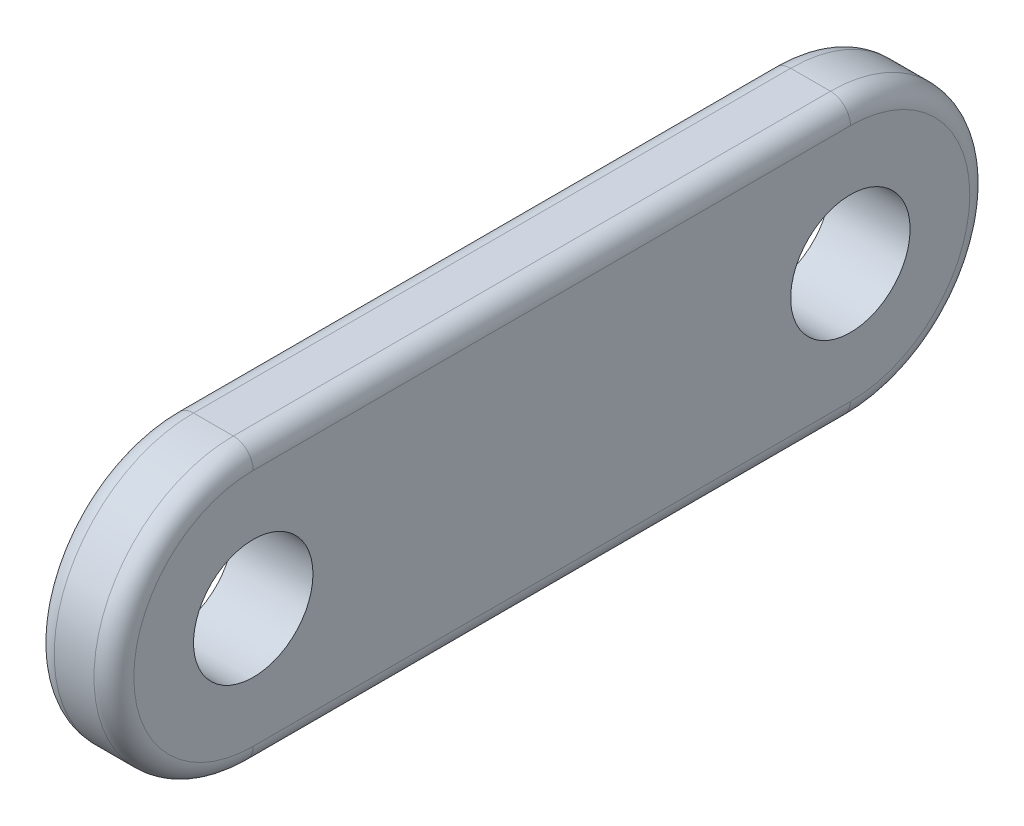
ISO-10303-21;
HEADER;
FILE_DESCRIPTION(('STEP AP214'),'2;1');
FILE_NAME('part.step','',(''),(''),'','','');
FILE_SCHEMA(('AUTOMOTIVE_DESIGN { 1 0 10303 214 1 1 1 1 }'));
ENDSEC;
DATA;
#1=APPLICATION_CONTEXT('core data for automotive mechanical design processes');
#2=APPLICATION_PROTOCOL_DEFINITION('international standard','automotive_design',2000,#1);
#3=PRODUCT_CONTEXT('',#1,'mechanical');
#4=PRODUCT('Part','Part','',(#3));
#5=PRODUCT_RELATED_PRODUCT_CATEGORY('part','',(#4));
#6=PRODUCT_DEFINITION_FORMATION('','',#4);
#7=PRODUCT_DEFINITION_CONTEXT('part definition',#1,'design');
#8=PRODUCT_DEFINITION('design','',#6,#7);
#9=PRODUCT_DEFINITION_SHAPE('','',#8);
#10=(LENGTH_UNIT() NAMED_UNIT(*) SI_UNIT(.MILLI.,.METRE.));
#11=(NAMED_UNIT(*) PLANE_ANGLE_UNIT() SI_UNIT($,.RADIAN.));
#12=(NAMED_UNIT(*) SI_UNIT($,.STERADIAN.) SOLID_ANGLE_UNIT());
#13=UNCERTAINTY_MEASURE_WITH_UNIT(LENGTH_MEASURE(1.E-05),#10,'distance_accuracy_value','');
#14=(GEOMETRIC_REPRESENTATION_CONTEXT(3) GLOBAL_UNCERTAINTY_ASSIGNED_CONTEXT((#13)) GLOBAL_UNIT_ASSIGNED_CONTEXT((#10,
#11,#12)) REPRESENTATION_CONTEXT('',''));
#15=CARTESIAN_POINT('',(0.,0.,0.));
#16=DIRECTION('',(0.,0.,1.));
#17=DIRECTION('',(1.,0.,0.));
#18=AXIS2_PLACEMENT_3D('',#15,#16,#17);
#19=CARTESIAN_POINT('',(4.,0.,15.));
#20=DIRECTION('',(1.,0.,0.));
#21=DIRECTION('',(0.,0.,-1.));
#22=AXIS2_PLACEMENT_3D('',#19,#20,#21);
#23=PLANE('',#22);
#24=DIRECTION('',(0.,0.,-1.));
#25=VECTOR('',#24,1.);
#26=CARTESIAN_POINT('',(4.,-6.00000000000001,-15.));
#27=LINE('',#26,#25);
#28=CARTESIAN_POINT('',(4.,-6.00000000000001,15.));
#29=VERTEX_POINT('',#28);
#30=CARTESIAN_POINT('',(4.,-6.00000000000001,-15.));
#31=VERTEX_POINT('',#30);
#32=EDGE_CURVE('E62',#29,#31,#27,.T.);
#33=ORIENTED_EDGE('',*,*,#32,.T.);
#34=CARTESIAN_POINT('',(4.,0.,-15.));
#35=DIRECTION('',(1.,0.,0.));
#36=DIRECTION('',(0.,0.,-1.));
#37=AXIS2_PLACEMENT_3D('',#34,#35,#36);
#38=CIRCLE('',#37,6.00000000000001);
#39=CARTESIAN_POINT('',(4.,6.00000000000001,-15.));
#40=VERTEX_POINT('',#39);
#41=EDGE_CURVE('E122',#31,#40,#38,.T.);
#42=ORIENTED_EDGE('',*,*,#41,.T.);
#43=DIRECTION('',(0.,0.,1.));
#44=VECTOR('',#43,1.);
#45=CARTESIAN_POINT('',(4.,6.00000000000001,15.));
#46=LINE('',#45,#44);
#47=CARTESIAN_POINT('',(4.,6.00000000000001,15.));
#48=VERTEX_POINT('',#47);
#49=EDGE_CURVE('E148',#40,#48,#46,.T.);
#50=ORIENTED_EDGE('',*,*,#49,.T.);
#51=CARTESIAN_POINT('',(4.,0.,15.));
#52=DIRECTION('',(1.,0.,0.));
#53=DIRECTION('',(0.,0.,-1.));
#54=AXIS2_PLACEMENT_3D('',#51,#52,#53);
#55=CIRCLE('',#54,6.00000000000001);
#56=EDGE_CURVE('E67',#48,#29,#55,.T.);
#57=ORIENTED_EDGE('',*,*,#56,.T.);
#58=EDGE_LOOP('',(#33,#42,#50,#57));
#59=FACE_BOUND('',#58,.T.);
#60=CARTESIAN_POINT('',(4.,0.,15.));
#61=DIRECTION('',(1.,0.,0.));
#62=DIRECTION('',(0.,0.,-1.));
#63=AXIS2_PLACEMENT_3D('',#60,#61,#62);
#64=CIRCLE('',#63,2.99999999999999);
#65=CARTESIAN_POINT('',(4.,0.,12.));
#66=VERTEX_POINT('',#65);
#67=EDGE_CURVE('E202',#66,#66,#64,.T.);
#68=ORIENTED_EDGE('',*,*,#67,.F.);
#69=EDGE_LOOP('',(#68));
#70=FACE_BOUND('',#69,.T.);
#71=CARTESIAN_POINT('',(4.,0.,-15.));
#72=DIRECTION('',(1.,0.,0.));
#73=DIRECTION('',(0.,0.,-1.));
#74=AXIS2_PLACEMENT_3D('',#71,#72,#73);
#75=CIRCLE('',#74,3.);
#76=CARTESIAN_POINT('',(4.,0.,-18.));
#77=VERTEX_POINT('',#76);
#78=EDGE_CURVE('E192',#77,#77,#75,.T.);
#79=ORIENTED_EDGE('',*,*,#78,.F.);
#80=EDGE_LOOP('',(#79));
#81=FACE_BOUND('',#80,.T.);
#82=ADVANCED_FACE('F44',(#59,#70,#81),#23,.T.);
#83=CARTESIAN_POINT('',(0.,0.,15.));
#84=DIRECTION('',(1.,0.,0.));
#85=DIRECTION('',(0.,0.,-1.));
#86=AXIS2_PLACEMENT_3D('',#83,#84,#85);
#87=PLANE('',#86);
#88=DIRECTION('',(0.,0.,1.));
#89=VECTOR('',#88,1.);
#90=CARTESIAN_POINT('',(0.,6.00000000000001,15.));
#91=LINE('',#90,#89);
#92=CARTESIAN_POINT('',(0.,6.00000000000001,15.));
#93=VERTEX_POINT('',#92);
#94=CARTESIAN_POINT('',(0.,6.00000000000001,-15.));
#95=VERTEX_POINT('',#94);
#96=EDGE_CURVE('E218',#93,#95,#91,.F.);
#97=ORIENTED_EDGE('',*,*,#96,.T.);
#98=CARTESIAN_POINT('',(0.,0.,-15.));
#99=DIRECTION('',(1.,0.,0.));
#100=DIRECTION('',(0.,0.,-1.));
#101=AXIS2_PLACEMENT_3D('',#98,#99,#100);
#102=CIRCLE('',#101,6.00000000000001);
#103=CARTESIAN_POINT('',(0.,-6.00000000000001,-15.));
#104=VERTEX_POINT('',#103);
#105=EDGE_CURVE('E227',#95,#104,#102,.F.);
#106=ORIENTED_EDGE('',*,*,#105,.T.);
#107=DIRECTION('',(0.,0.,-1.));
#108=VECTOR('',#107,1.);
#109=CARTESIAN_POINT('',(0.,-6.00000000000001,15.));
#110=LINE('',#109,#108);
#111=CARTESIAN_POINT('',(0.,-6.00000000000001,15.));
#112=VERTEX_POINT('',#111);
#113=EDGE_CURVE('E224',#104,#112,#110,.F.);
#114=ORIENTED_EDGE('',*,*,#113,.T.);
#115=CARTESIAN_POINT('',(0.,0.,15.));
#116=DIRECTION('',(1.,0.,0.));
#117=DIRECTION('',(0.,0.,-1.));
#118=AXIS2_PLACEMENT_3D('',#115,#116,#117);
#119=CIRCLE('',#118,6.00000000000001);
#120=EDGE_CURVE('E221',#112,#93,#119,.F.);
#121=ORIENTED_EDGE('',*,*,#120,.T.);
#122=EDGE_LOOP('',(#97,#106,#114,#121));
#123=FACE_BOUND('',#122,.T.);
#124=CARTESIAN_POINT('',(0.,0.,15.));
#125=DIRECTION('',(1.,0.,0.));
#126=DIRECTION('',(0.,0.,-1.));
#127=AXIS2_PLACEMENT_3D('',#124,#125,#126);
#128=CIRCLE('',#127,2.99999999999999);
#129=CARTESIAN_POINT('',(0.,0.,12.));
#130=VERTEX_POINT('',#129);
#131=EDGE_CURVE('E199',#130,#130,#128,.T.);
#132=ORIENTED_EDGE('',*,*,#131,.T.);
#133=EDGE_LOOP('',(#132));
#134=FACE_BOUND('',#133,.T.);
#135=CARTESIAN_POINT('',(0.,0.,-15.));
#136=DIRECTION('',(1.,0.,0.));
#137=DIRECTION('',(0.,0.,-1.));
#138=AXIS2_PLACEMENT_3D('',#135,#136,#137);
#139=CIRCLE('',#138,3.);
#140=CARTESIAN_POINT('',(0.,0.,-18.));
#141=VERTEX_POINT('',#140);
#142=EDGE_CURVE('E184',#141,#141,#139,.T.);
#143=ORIENTED_EDGE('',*,*,#142,.T.);
#144=EDGE_LOOP('',(#143));
#145=FACE_BOUND('',#144,.T.);
#146=ADVANCED_FACE('F277',(#123,#134,#145),#87,.F.);
#147=CARTESIAN_POINT('',(4.,0.,15.));
#148=DIRECTION('',(-1.,0.,0.));
#149=DIRECTION('',(0.,0.,1.));
#150=AXIS2_PLACEMENT_3D('',#147,#148,#149);
#151=CYLINDRICAL_SURFACE('',#150,7.00000000000001);
#152=DIRECTION('',(-1.,0.,0.));
#153=VECTOR('',#152,1.);
#154=CARTESIAN_POINT('',(4.,7.00000000000001,15.));
#155=LINE('',#154,#153);
#156=CARTESIAN_POINT('',(3.,7.00000000000001,15.));
#157=VERTEX_POINT('',#156);
#158=CARTESIAN_POINT('',(1.,7.00000000000001,15.));
#159=VERTEX_POINT('',#158);
#160=EDGE_CURVE('E116',#157,#159,#155,.T.);
#161=ORIENTED_EDGE('',*,*,#160,.T.);
#162=CARTESIAN_POINT('',(1.,0.,15.));
#163=DIRECTION('',(1.,0.,0.));
#164=DIRECTION('',(0.,0.,-1.));
#165=AXIS2_PLACEMENT_3D('',#162,#163,#164);
#166=CIRCLE('',#165,7.00000000000001);
#167=CARTESIAN_POINT('',(1.,-7.00000000000001,15.));
#168=VERTEX_POINT('',#167);
#169=EDGE_CURVE('E240',#159,#168,#166,.T.);
#170=ORIENTED_EDGE('',*,*,#169,.T.);
#171=DIRECTION('',(-1.,0.,0.));
#172=VECTOR('',#171,1.);
#173=CARTESIAN_POINT('',(4.,-7.00000000000001,15.));
#174=LINE('',#173,#172);
#175=CARTESIAN_POINT('',(3.,-7.00000000000001,15.));
#176=VERTEX_POINT('',#175);
#177=EDGE_CURVE('E145',#176,#168,#174,.T.);
#178=ORIENTED_EDGE('',*,*,#177,.F.);
#179=CARTESIAN_POINT('',(3.,0.,15.));
#180=DIRECTION('',(1.,0.,0.));
#181=DIRECTION('',(0.,0.,-1.));
#182=AXIS2_PLACEMENT_3D('',#179,#180,#181);
#183=CIRCLE('',#182,7.00000000000001);
#184=EDGE_CURVE('E237',#176,#157,#183,.F.);
#185=ORIENTED_EDGE('',*,*,#184,.T.);
#186=EDGE_LOOP('',(#161,#170,#178,#185));
#187=FACE_BOUND('',#186,.T.);
#188=ADVANCED_FACE('F259',(#187),#151,.T.);
#189=CARTESIAN_POINT('',(4.,-7.00000000000001,15.));
#190=DIRECTION('',(0.,1.,0.));
#191=DIRECTION('',(0.,0.,1.));
#192=AXIS2_PLACEMENT_3D('',#189,#190,#191);
#193=PLANE('',#192);
#194=ORIENTED_EDGE('',*,*,#177,.T.);
#195=DIRECTION('',(0.,0.,-1.));
#196=VECTOR('',#195,1.);
#197=CARTESIAN_POINT('',(1.,-7.00000000000001,15.));
#198=LINE('',#197,#196);
#199=CARTESIAN_POINT('',(1.,-7.00000000000001,-15.));
#200=VERTEX_POINT('',#199);
#201=EDGE_CURVE('E234',#168,#200,#198,.T.);
#202=ORIENTED_EDGE('',*,*,#201,.T.);
#203=DIRECTION('',(-1.,0.,0.));
#204=VECTOR('',#203,1.);
#205=CARTESIAN_POINT('',(4.,-7.00000000000001,-15.));
#206=LINE('',#205,#204);
#207=CARTESIAN_POINT('',(3.,-7.00000000000001,-15.));
#208=VERTEX_POINT('',#207);
#209=EDGE_CURVE('E135',#208,#200,#206,.T.);
#210=ORIENTED_EDGE('',*,*,#209,.F.);
#211=DIRECTION('',(0.,0.,-1.));
#212=VECTOR('',#211,1.);
#213=CARTESIAN_POINT('',(3.,-7.00000000000001,15.));
#214=LINE('',#213,#212);
#215=EDGE_CURVE('E231',#208,#176,#214,.F.);
#216=ORIENTED_EDGE('',*,*,#215,.T.);
#217=EDGE_LOOP('',(#194,#202,#210,#216));
#218=FACE_BOUND('',#217,.T.);
#219=ADVANCED_FACE('F257',(#218),#193,.F.);
#220=CARTESIAN_POINT('',(4.,0.,-15.));
#221=DIRECTION('',(-1.,0.,0.));
#222=DIRECTION('',(0.,0.,1.));
#223=AXIS2_PLACEMENT_3D('',#220,#221,#222);
#224=CYLINDRICAL_SURFACE('',#223,7.00000000000001);
#225=ORIENTED_EDGE('',*,*,#209,.T.);
#226=CARTESIAN_POINT('',(1.,0.,-15.));
#227=DIRECTION('',(1.,0.,0.));
#228=DIRECTION('',(0.,0.,-1.));
#229=AXIS2_PLACEMENT_3D('',#226,#227,#228);
#230=CIRCLE('',#229,7.00000000000001);
#231=CARTESIAN_POINT('',(1.,7.00000000000001,-15.));
#232=VERTEX_POINT('',#231);
#233=EDGE_CURVE('E133',#200,#232,#230,.T.);
#234=ORIENTED_EDGE('',*,*,#233,.T.);
#235=DIRECTION('',(-1.,0.,0.));
#236=VECTOR('',#235,1.);
#237=CARTESIAN_POINT('',(4.,7.00000000000001,-15.));
#238=LINE('',#237,#236);
#239=CARTESIAN_POINT('',(3.,7.00000000000001,-15.));
#240=VERTEX_POINT('',#239);
#241=EDGE_CURVE('E114',#240,#232,#238,.T.);
#242=ORIENTED_EDGE('',*,*,#241,.F.);
#243=CARTESIAN_POINT('',(3.,0.,-15.));
#244=DIRECTION('',(1.,0.,0.));
#245=DIRECTION('',(0.,0.,-1.));
#246=AXIS2_PLACEMENT_3D('',#243,#244,#245);
#247=CIRCLE('',#246,7.00000000000001);
#248=EDGE_CURVE('E130',#240,#208,#247,.F.);
#249=ORIENTED_EDGE('',*,*,#248,.T.);
#250=EDGE_LOOP('',(#225,#234,#242,#249));
#251=FACE_BOUND('',#250,.T.);
#252=ADVANCED_FACE('F129',(#251),#224,.T.);
#253=CARTESIAN_POINT('',(4.,7.00000000000001,15.));
#254=DIRECTION('',(0.,-1.,0.));
#255=DIRECTION('',(0.,0.,-1.));
#256=AXIS2_PLACEMENT_3D('',#253,#254,#255);
#257=PLANE('',#256);
#258=ORIENTED_EDGE('',*,*,#241,.T.);
#259=DIRECTION('',(0.,0.,1.));
#260=VECTOR('',#259,1.);
#261=CARTESIAN_POINT('',(1.,7.00000000000001,15.));
#262=LINE('',#261,#260);
#263=EDGE_CURVE('E11',#232,#159,#262,.T.);
#264=ORIENTED_EDGE('',*,*,#263,.T.);
#265=ORIENTED_EDGE('',*,*,#160,.F.);
#266=DIRECTION('',(0.,0.,1.));
#267=VECTOR('',#266,1.);
#268=CARTESIAN_POINT('',(3.,7.00000000000001,-15.));
#269=LINE('',#268,#267);
#270=EDGE_CURVE('E54',#157,#240,#269,.F.);
#271=ORIENTED_EDGE('',*,*,#270,.T.);
#272=EDGE_LOOP('',(#258,#264,#265,#271));
#273=FACE_BOUND('',#272,.T.);
#274=ADVANCED_FACE('F113',(#273),#257,.F.);
#275=CARTESIAN_POINT('',(4.,0.,15.));
#276=DIRECTION('',(-1.,0.,0.));
#277=DIRECTION('',(0.,0.,1.));
#278=AXIS2_PLACEMENT_3D('',#275,#276,#277);
#279=CYLINDRICAL_SURFACE('',#278,2.99999999999999);
#280=ORIENTED_EDGE('',*,*,#67,.T.);
#281=EDGE_LOOP('',(#280));
#282=FACE_BOUND('',#281,.T.);
#283=ORIENTED_EDGE('',*,*,#131,.F.);
#284=EDGE_LOOP('',(#283));
#285=FACE_BOUND('',#284,.T.);
#286=ADVANCED_FACE('F285',(#282,#285),#279,.F.);
#287=CARTESIAN_POINT('',(4.,0.,-15.));
#288=DIRECTION('',(-1.,0.,0.));
#289=DIRECTION('',(0.,0.,1.));
#290=AXIS2_PLACEMENT_3D('',#287,#288,#289);
#291=CYLINDRICAL_SURFACE('',#290,3.);
#292=ORIENTED_EDGE('',*,*,#78,.T.);
#293=EDGE_LOOP('',(#292));
#294=FACE_BOUND('',#293,.T.);
#295=ORIENTED_EDGE('',*,*,#142,.F.);
#296=EDGE_LOOP('',(#295));
#297=FACE_BOUND('',#296,.T.);
#298=ADVANCED_FACE('F317',(#294,#297),#291,.F.);
#299=CARTESIAN_POINT('',(1.,0.,15.));
#300=DIRECTION('',(1.,0.,0.));
#301=DIRECTION('',(0.,0.,-1.));
#302=AXIS2_PLACEMENT_3D('',#299,#300,#301);
#303=TOROIDAL_SURFACE('',#302,6.00000000000001,1.);
#304=CARTESIAN_POINT('',(1.,6.00000000000001,15.));
#305=DIRECTION('',(0.,0.,-1.));
#306=DIRECTION('',(-1.,0.,0.));
#307=AXIS2_PLACEMENT_3D('',#304,#305,#306);
#308=CIRCLE('',#307,1.);
#309=EDGE_CURVE('E174',#93,#159,#308,.T.);
#310=ORIENTED_EDGE('',*,*,#309,.F.);
#311=ORIENTED_EDGE('',*,*,#120,.F.);
#312=CARTESIAN_POINT('',(1.,-6.00000000000001,15.));
#313=DIRECTION('',(0.,0.,-1.));
#314=DIRECTION('',(-1.,0.,0.));
#315=AXIS2_PLACEMENT_3D('',#312,#313,#314);
#316=CIRCLE('',#315,1.);
#317=EDGE_CURVE('E156',#168,#112,#316,.T.);
#318=ORIENTED_EDGE('',*,*,#317,.F.);
#319=ORIENTED_EDGE('',*,*,#169,.F.);
#320=EDGE_LOOP('',(#310,#311,#318,#319));
#321=FACE_BOUND('',#320,.T.);
#322=ADVANCED_FACE('F262',(#321),#303,.T.);
#323=CARTESIAN_POINT('',(1.,-6.00000000000001,15.));
#324=DIRECTION('',(0.,0.,-1.));
#325=DIRECTION('',(-1.,0.,0.));
#326=AXIS2_PLACEMENT_3D('',#323,#324,#325);
#327=CYLINDRICAL_SURFACE('',#326,1.);
#328=ORIENTED_EDGE('',*,*,#317,.T.);
#329=ORIENTED_EDGE('',*,*,#113,.F.);
#330=CARTESIAN_POINT('',(1.,-6.00000000000001,-15.));
#331=DIRECTION('',(0.,0.,-1.));
#332=DIRECTION('',(-1.,0.,0.));
#333=AXIS2_PLACEMENT_3D('',#330,#331,#332);
#334=CIRCLE('',#333,1.);
#335=EDGE_CURVE('E166',#200,#104,#334,.T.);
#336=ORIENTED_EDGE('',*,*,#335,.F.);
#337=ORIENTED_EDGE('',*,*,#201,.F.);
#338=EDGE_LOOP('',(#328,#329,#336,#337));
#339=FACE_BOUND('',#338,.T.);
#340=ADVANCED_FACE('F265',(#339),#327,.T.);
#341=CARTESIAN_POINT('',(1.,6.00000000000001,15.));
#342=DIRECTION('',(0.,0.,1.));
#343=DIRECTION('',(1.,0.,0.));
#344=AXIS2_PLACEMENT_3D('',#341,#342,#343);
#345=CYLINDRICAL_SURFACE('',#344,1.);
#346=ORIENTED_EDGE('',*,*,#309,.T.);
#347=ORIENTED_EDGE('',*,*,#263,.F.);
#348=CARTESIAN_POINT('',(1.,6.00000000000001,-15.));
#349=DIRECTION('',(0.,0.,-1.));
#350=DIRECTION('',(-1.,0.,0.));
#351=AXIS2_PLACEMENT_3D('',#348,#349,#350);
#352=CIRCLE('',#351,1.);
#353=EDGE_CURVE('E162',#95,#232,#352,.T.);
#354=ORIENTED_EDGE('',*,*,#353,.F.);
#355=ORIENTED_EDGE('',*,*,#96,.F.);
#356=EDGE_LOOP('',(#346,#347,#354,#355));
#357=FACE_BOUND('',#356,.T.);
#358=ADVANCED_FACE('F268',(#357),#345,.T.);
#359=CARTESIAN_POINT('',(1.,0.,-15.));
#360=DIRECTION('',(1.,0.,0.));
#361=DIRECTION('',(0.,0.,-1.));
#362=AXIS2_PLACEMENT_3D('',#359,#360,#361);
#363=TOROIDAL_SURFACE('',#362,6.00000000000001,1.);
#364=ORIENTED_EDGE('',*,*,#335,.T.);
#365=ORIENTED_EDGE('',*,*,#105,.F.);
#366=ORIENTED_EDGE('',*,*,#353,.T.);
#367=ORIENTED_EDGE('',*,*,#233,.F.);
#368=EDGE_LOOP('',(#364,#365,#366,#367));
#369=FACE_BOUND('',#368,.T.);
#370=ADVANCED_FACE('F266',(#369),#363,.T.);
#371=CARTESIAN_POINT('',(3.,0.,15.));
#372=DIRECTION('',(1.,0.,0.));
#373=DIRECTION('',(0.,0.,-1.));
#374=AXIS2_PLACEMENT_3D('',#371,#372,#373);
#375=TOROIDAL_SURFACE('',#374,6.00000000000001,1.);
#376=CARTESIAN_POINT('',(3.,6.00000000000001,15.));
#377=DIRECTION('',(0.,0.,-1.));
#378=DIRECTION('',(-1.,0.,0.));
#379=AXIS2_PLACEMENT_3D('',#376,#377,#378);
#380=CIRCLE('',#379,1.);
#381=EDGE_CURVE('E153',#157,#48,#380,.T.);
#382=ORIENTED_EDGE('',*,*,#381,.F.);
#383=ORIENTED_EDGE('',*,*,#184,.F.);
#384=CARTESIAN_POINT('',(3.,-6.00000000000001,15.));
#385=DIRECTION('',(0.,0.,-1.));
#386=DIRECTION('',(-1.,0.,0.));
#387=AXIS2_PLACEMENT_3D('',#384,#385,#386);
#388=CIRCLE('',#387,1.);
#389=EDGE_CURVE('E48',#29,#176,#388,.T.);
#390=ORIENTED_EDGE('',*,*,#389,.F.);
#391=ORIENTED_EDGE('',*,*,#56,.F.);
#392=EDGE_LOOP('',(#382,#383,#390,#391));
#393=FACE_BOUND('',#392,.T.);
#394=ADVANCED_FACE('F46',(#393),#375,.T.);
#395=CARTESIAN_POINT('',(3.,-6.00000000000001,15.));
#396=DIRECTION('',(0.,0.,1.));
#397=DIRECTION('',(1.,0.,0.));
#398=AXIS2_PLACEMENT_3D('',#395,#396,#397);
#399=CYLINDRICAL_SURFACE('',#398,1.);
#400=ORIENTED_EDGE('',*,*,#389,.T.);
#401=ORIENTED_EDGE('',*,*,#215,.F.);
#402=CARTESIAN_POINT('',(3.,-6.00000000000001,-15.));
#403=DIRECTION('',(0.,0.,-1.));
#404=DIRECTION('',(-1.,0.,0.));
#405=AXIS2_PLACEMENT_3D('',#402,#403,#404);
#406=CIRCLE('',#405,1.);
#407=EDGE_CURVE('E142',#31,#208,#406,.T.);
#408=ORIENTED_EDGE('',*,*,#407,.F.);
#409=ORIENTED_EDGE('',*,*,#32,.F.);
#410=EDGE_LOOP('',(#400,#401,#408,#409));
#411=FACE_BOUND('',#410,.T.);
#412=ADVANCED_FACE('F254',(#411),#399,.T.);
#413=CARTESIAN_POINT('',(3.,6.00000000000001,15.));
#414=DIRECTION('',(0.,0.,-1.));
#415=DIRECTION('',(-1.,0.,0.));
#416=AXIS2_PLACEMENT_3D('',#413,#414,#415);
#417=CYLINDRICAL_SURFACE('',#416,1.);
#418=ORIENTED_EDGE('',*,*,#381,.T.);
#419=ORIENTED_EDGE('',*,*,#49,.F.);
#420=CARTESIAN_POINT('',(3.,6.00000000000001,-15.));
#421=DIRECTION('',(0.,0.,-1.));
#422=DIRECTION('',(-1.,0.,0.));
#423=AXIS2_PLACEMENT_3D('',#420,#421,#422);
#424=CIRCLE('',#423,1.);
#425=EDGE_CURVE('E140',#240,#40,#424,.T.);
#426=ORIENTED_EDGE('',*,*,#425,.F.);
#427=ORIENTED_EDGE('',*,*,#270,.F.);
#428=EDGE_LOOP('',(#418,#419,#426,#427));
#429=FACE_BOUND('',#428,.T.);
#430=ADVANCED_FACE('F147',(#429),#417,.T.);
#431=CARTESIAN_POINT('',(3.,0.,-15.));
#432=DIRECTION('',(1.,0.,0.));
#433=DIRECTION('',(0.,0.,-1.));
#434=AXIS2_PLACEMENT_3D('',#431,#432,#433);
#435=TOROIDAL_SURFACE('',#434,6.00000000000001,1.);
#436=ORIENTED_EDGE('',*,*,#407,.T.);
#437=ORIENTED_EDGE('',*,*,#248,.F.);
#438=ORIENTED_EDGE('',*,*,#425,.T.);
#439=ORIENTED_EDGE('',*,*,#41,.F.);
#440=EDGE_LOOP('',(#436,#437,#438,#439));
#441=FACE_BOUND('',#440,.T.);
#442=ADVANCED_FACE('F138',(#441),#435,.T.);
#443=CLOSED_SHELL('',(#82,#146,#188,#219,#252,#274,#286,#298,#322,#340,#358,#370,#394,#412,#430,#442));
#444=MANIFOLD_SOLID_BREP('B2',#443);
#445=ADVANCED_BREP_SHAPE_REPRESENTATION('',(#18,#444),#14);
#446=SHAPE_DEFINITION_REPRESENTATION(#9,#445);
ENDSEC;
END-ISO-10303-21;
